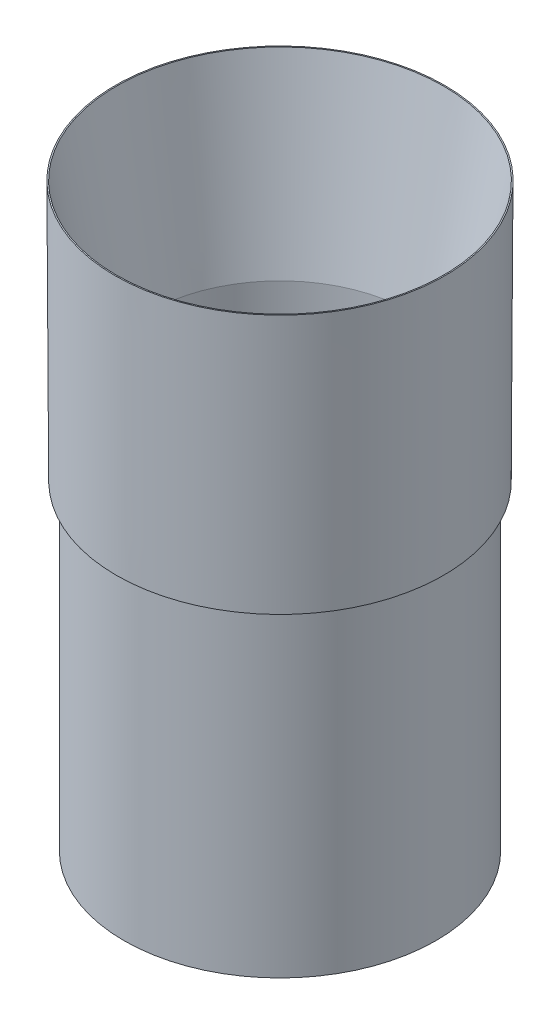
ISO-10303-21;
HEADER;
FILE_DESCRIPTION(('STEP AP214'),'2;1');
FILE_NAME('part.step','',(''),(''),'','','');
FILE_SCHEMA(('AUTOMOTIVE_DESIGN { 1 0 10303 214 1 1 1 1 }'));
ENDSEC;
DATA;
#1=APPLICATION_CONTEXT('core data for automotive mechanical design processes');
#2=APPLICATION_PROTOCOL_DEFINITION('international standard','automotive_design',2000,#1);
#3=PRODUCT_CONTEXT('',#1,'mechanical');
#4=PRODUCT('Part','Part','',(#3));
#5=PRODUCT_RELATED_PRODUCT_CATEGORY('part','',(#4));
#6=PRODUCT_DEFINITION_FORMATION('','',#4);
#7=PRODUCT_DEFINITION_CONTEXT('part definition',#1,'design');
#8=PRODUCT_DEFINITION('design','',#6,#7);
#9=PRODUCT_DEFINITION_SHAPE('','',#8);
#10=(LENGTH_UNIT() NAMED_UNIT(*) SI_UNIT(.MILLI.,.METRE.));
#11=(NAMED_UNIT(*) PLANE_ANGLE_UNIT() SI_UNIT($,.RADIAN.));
#12=(NAMED_UNIT(*) SI_UNIT($,.STERADIAN.) SOLID_ANGLE_UNIT());
#13=UNCERTAINTY_MEASURE_WITH_UNIT(LENGTH_MEASURE(1.E-05),#10,'distance_accuracy_value','');
#14=(GEOMETRIC_REPRESENTATION_CONTEXT(3) GLOBAL_UNCERTAINTY_ASSIGNED_CONTEXT((#13)) GLOBAL_UNIT_ASSIGNED_CONTEXT((#10,
#11,#12)) REPRESENTATION_CONTEXT('',''));
#15=CARTESIAN_POINT('',(0.,0.,0.));
#16=DIRECTION('',(0.,0.,1.));
#17=DIRECTION('',(1.,0.,0.));
#18=AXIS2_PLACEMENT_3D('',#15,#16,#17);
#19=CARTESIAN_POINT('',(0.,0.,0.));
#20=DIRECTION('',(0.,-1.,0.));
#21=DIRECTION('',(0.,0.,-1.));
#22=AXIS2_PLACEMENT_3D('',#19,#20,#21);
#23=CYLINDRICAL_SURFACE('',#22,49.53);
#24=CARTESIAN_POINT('',(0.,-101.6,0.));
#25=DIRECTION('',(0.,-1.,0.));
#26=DIRECTION('',(0.,0.,-1.));
#27=AXIS2_PLACEMENT_3D('',#24,#25,#26);
#28=CIRCLE('',#27,49.53);
#29=CARTESIAN_POINT('',(0.,-101.6,-49.53));
#30=VERTEX_POINT('',#29);
#31=EDGE_CURVE('E10',#30,#30,#28,.T.);
#32=ORIENTED_EDGE('',*,*,#31,.F.);
#33=EDGE_LOOP('',(#32));
#34=FACE_BOUND('',#33,.T.);
#35=CARTESIAN_POINT('',(0.,0.,0.));
#36=DIRECTION('',(0.,-1.,0.));
#37=DIRECTION('',(0.,0.,-1.));
#38=AXIS2_PLACEMENT_3D('',#35,#36,#37);
#39=CIRCLE('',#38,49.53);
#40=CARTESIAN_POINT('',(0.,0.,-49.53));
#41=VERTEX_POINT('',#40);
#42=EDGE_CURVE('E80',#41,#41,#39,.T.);
#43=ORIENTED_EDGE('',*,*,#42,.T.);
#44=EDGE_LOOP('',(#43));
#45=FACE_BOUND('',#44,.T.);
#46=ADVANCED_FACE('F41',(#34,#45),#23,.T.);
#47=CARTESIAN_POINT('',(-47.244,-101.6,0.));
#48=DIRECTION('',(0.,1.,0.));
#49=DIRECTION('',(0.,0.,1.));
#50=AXIS2_PLACEMENT_3D('',#47,#48,#49);
#51=PLANE('',#50);
#52=CARTESIAN_POINT('',(0.,-101.6,0.));
#53=DIRECTION('',(0.,-1.,0.));
#54=DIRECTION('',(0.,0.,-1.));
#55=AXIS2_PLACEMENT_3D('',#52,#53,#54);
#56=CIRCLE('',#55,47.244);
#57=CARTESIAN_POINT('',(0.,-101.6,-47.244));
#58=VERTEX_POINT('',#57);
#59=EDGE_CURVE('E48',#58,#58,#56,.T.);
#60=ORIENTED_EDGE('',*,*,#59,.F.);
#61=EDGE_LOOP('',(#60));
#62=FACE_BOUND('',#61,.T.);
#63=ORIENTED_EDGE('',*,*,#31,.T.);
#64=EDGE_LOOP('',(#63));
#65=FACE_BOUND('',#64,.T.);
#66=ADVANCED_FACE('F124',(#62,#65),#51,.F.);
#67=CARTESIAN_POINT('',(0.,0.,0.));
#68=DIRECTION('',(0.,-1.,0.));
#69=DIRECTION('',(0.,0.,-1.));
#70=AXIS2_PLACEMENT_3D('',#67,#68,#69);
#71=CYLINDRICAL_SURFACE('',#70,47.244);
#72=CARTESIAN_POINT('',(0.,0.,0.));
#73=DIRECTION('',(0.,-1.,0.));
#74=DIRECTION('',(0.,0.,-1.));
#75=AXIS2_PLACEMENT_3D('',#72,#73,#74);
#76=CIRCLE('',#75,47.244);
#77=CARTESIAN_POINT('',(0.,0.,-47.244));
#78=VERTEX_POINT('',#77);
#79=EDGE_CURVE('E53',#78,#78,#76,.T.);
#80=ORIENTED_EDGE('',*,*,#79,.F.);
#81=EDGE_LOOP('',(#80));
#82=FACE_BOUND('',#81,.T.);
#83=ORIENTED_EDGE('',*,*,#59,.T.);
#84=EDGE_LOOP('',(#83));
#85=FACE_BOUND('',#84,.T.);
#86=ADVANCED_FACE('F119',(#82,#85),#71,.F.);
#87=CARTESIAN_POINT('',(-41.866089445666,0.,0.));
#88=DIRECTION('',(0.,1.,0.));
#89=DIRECTION('',(0.,0.,1.));
#90=AXIS2_PLACEMENT_3D('',#87,#88,#89);
#91=PLANE('',#90);
#92=CARTESIAN_POINT('',(0.,0.,0.));
#93=DIRECTION('',(0.,-1.,0.));
#94=DIRECTION('',(0.,0.,-1.));
#95=AXIS2_PLACEMENT_3D('',#92,#93,#94);
#96=CIRCLE('',#95,41.866089445666);
#97=CARTESIAN_POINT('',(0.,0.,-41.866089445666));
#98=VERTEX_POINT('',#97);
#99=EDGE_CURVE('E58',#98,#98,#96,.T.);
#100=ORIENTED_EDGE('',*,*,#99,.F.);
#101=EDGE_LOOP('',(#100));
#102=FACE_BOUND('',#101,.T.);
#103=ORIENTED_EDGE('',*,*,#79,.T.);
#104=EDGE_LOOP('',(#103));
#105=FACE_BOUND('',#104,.T.);
#106=ADVANCED_FACE('F113',(#102,#105),#91,.F.);
#107=CARTESIAN_POINT('',(0.,0.,0.));
#108=DIRECTION('',(0.,-1.,0.));
#109=DIRECTION('',(0.,0.,-1.));
#110=AXIS2_PLACEMENT_3D('',#107,#108,#109);
#111=CYLINDRICAL_SURFACE('',#110,41.866089445666);
#112=CARTESIAN_POINT('',(0.,25.4,0.));
#113=DIRECTION('',(0.,-1.,0.));
#114=DIRECTION('',(0.,0.,-1.));
#115=AXIS2_PLACEMENT_3D('',#112,#113,#114);
#116=CIRCLE('',#115,41.866089445666);
#117=CARTESIAN_POINT('',(0.,25.4,-41.866089445666));
#118=VERTEX_POINT('',#117);
#119=EDGE_CURVE('E64',#118,#118,#116,.T.);
#120=ORIENTED_EDGE('',*,*,#119,.F.);
#121=EDGE_LOOP('',(#120));
#122=FACE_BOUND('',#121,.T.);
#123=ORIENTED_EDGE('',*,*,#99,.T.);
#124=EDGE_LOOP('',(#123));
#125=FACE_BOUND('',#124,.T.);
#126=ADVANCED_FACE('F107',(#122,#125),#111,.F.);
#127=CARTESIAN_POINT('',(0.,25.4,0.));
#128=DIRECTION('',(0.,1.,0.));
#129=DIRECTION('',(0.,0.,1.));
#130=AXIS2_PLACEMENT_3D('',#127,#128,#129);
#131=CONICAL_SURFACE('',#130,41.866089445666,0.174532925199434);
#132=CARTESIAN_POINT('',(0.,82.5489996247077,0.));
#133=DIRECTION('',(0.,-1.,0.));
#134=DIRECTION('',(0.,0.,-1.));
#135=AXIS2_PLACEMENT_3D('',#132,#133,#134);
#136=CIRCLE('',#135,51.943);
#137=CARTESIAN_POINT('',(0.,82.5489996247077,-51.943));
#138=VERTEX_POINT('',#137);
#139=EDGE_CURVE('E68',#138,#138,#136,.T.);
#140=ORIENTED_EDGE('',*,*,#139,.F.);
#141=EDGE_LOOP('',(#140));
#142=FACE_BOUND('',#141,.T.);
#143=ORIENTED_EDGE('',*,*,#119,.T.);
#144=EDGE_LOOP('',(#143));
#145=FACE_BOUND('',#144,.T.);
#146=ADVANCED_FACE('F101',(#142,#145),#131,.F.);
#147=CARTESIAN_POINT('',(-52.324,82.5489996247077,0.));
#148=DIRECTION('',(0.,-1.,0.));
#149=DIRECTION('',(0.,0.,-1.));
#150=AXIS2_PLACEMENT_3D('',#147,#148,#149);
#151=PLANE('',#150);
#152=CARTESIAN_POINT('',(0.,82.5489996247077,0.));
#153=DIRECTION('',(0.,-1.,0.));
#154=DIRECTION('',(0.,0.,-1.));
#155=AXIS2_PLACEMENT_3D('',#152,#153,#154);
#156=CIRCLE('',#155,52.324);
#157=CARTESIAN_POINT('',(0.,82.5489996247077,-52.324));
#158=VERTEX_POINT('',#157);
#159=EDGE_CURVE('E72',#158,#158,#156,.T.);
#160=ORIENTED_EDGE('',*,*,#159,.F.);
#161=EDGE_LOOP('',(#160));
#162=FACE_BOUND('',#161,.T.);
#163=ORIENTED_EDGE('',*,*,#139,.T.);
#164=EDGE_LOOP('',(#163));
#165=FACE_BOUND('',#164,.T.);
#166=ADVANCED_FACE('F95',(#162,#165),#151,.F.);
#167=CARTESIAN_POINT('',(0.,82.5489996247077,0.));
#168=DIRECTION('',(0.,1.,0.));
#169=DIRECTION('',(0.,0.,1.));
#170=AXIS2_PLACEMENT_3D('',#167,#168,#169);
#171=CONICAL_SURFACE('',#170,52.324,0.00492309680980575);
#172=CARTESIAN_POINT('',(0.,0.,0.));
#173=DIRECTION('',(0.,-1.,0.));
#174=DIRECTION('',(0.,0.,-1.));
#175=AXIS2_PLACEMENT_3D('',#172,#173,#174);
#176=CIRCLE('',#175,51.9176);
#177=CARTESIAN_POINT('',(0.,0.,-51.9176));
#178=VERTEX_POINT('',#177);
#179=EDGE_CURVE('E76',#178,#178,#176,.T.);
#180=ORIENTED_EDGE('',*,*,#179,.F.);
#181=EDGE_LOOP('',(#180));
#182=FACE_BOUND('',#181,.T.);
#183=ORIENTED_EDGE('',*,*,#159,.T.);
#184=EDGE_LOOP('',(#183));
#185=FACE_BOUND('',#184,.T.);
#186=ADVANCED_FACE('F89',(#182,#185),#171,.T.);
#187=CARTESIAN_POINT('',(-49.53,0.,0.));
#188=DIRECTION('',(0.,1.,0.));
#189=DIRECTION('',(0.,0.,1.));
#190=AXIS2_PLACEMENT_3D('',#187,#188,#189);
#191=PLANE('',#190);
#192=ORIENTED_EDGE('',*,*,#42,.F.);
#193=EDGE_LOOP('',(#192));
#194=FACE_BOUND('',#193,.T.);
#195=ORIENTED_EDGE('',*,*,#179,.T.);
#196=EDGE_LOOP('',(#195));
#197=FACE_BOUND('',#196,.T.);
#198=ADVANCED_FACE('F86',(#194,#197),#191,.F.);
#199=CLOSED_SHELL('',(#46,#66,#86,#106,#126,#146,#166,#186,#198));
#200=MANIFOLD_SOLID_BREP('B2',#199);
#201=ADVANCED_BREP_SHAPE_REPRESENTATION('',(#18,#200),#14);
#202=SHAPE_DEFINITION_REPRESENTATION(#9,#201);
ENDSEC;
END-ISO-10303-21;
